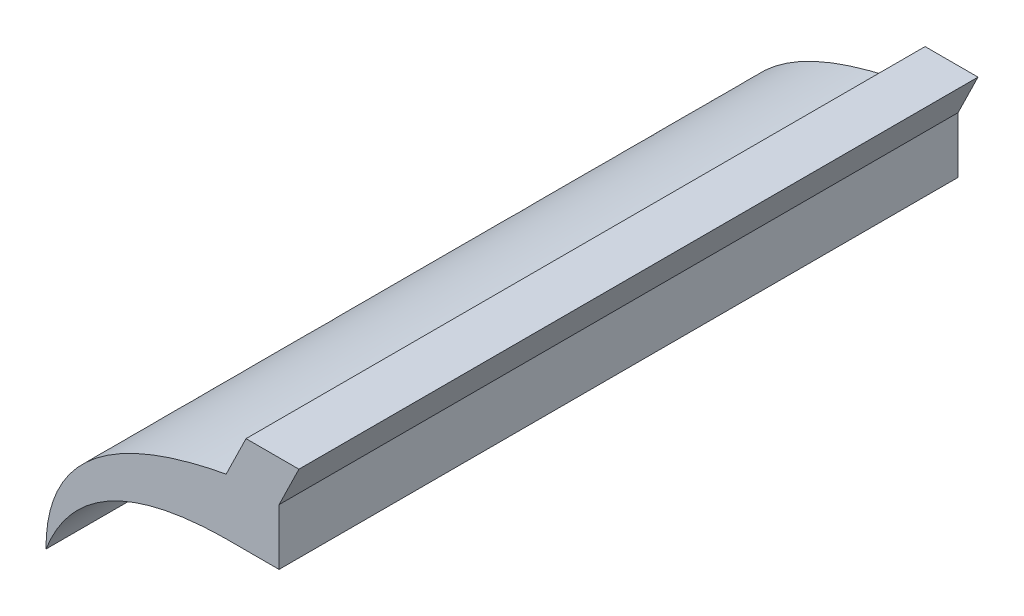
ISO-10303-21;
HEADER;
FILE_DESCRIPTION(('STEP AP214'),'2;1');
FILE_NAME('part.step','',(''),(''),'','','');
FILE_SCHEMA(('AUTOMOTIVE_DESIGN { 1 0 10303 214 1 1 1 1 }'));
ENDSEC;
DATA;
#1=APPLICATION_CONTEXT('core data for automotive mechanical design processes');
#2=APPLICATION_PROTOCOL_DEFINITION('international standard','automotive_design',2000,#1);
#3=PRODUCT_CONTEXT('',#1,'mechanical');
#4=PRODUCT('Part','Part','',(#3));
#5=PRODUCT_RELATED_PRODUCT_CATEGORY('part','',(#4));
#6=PRODUCT_DEFINITION_FORMATION('','',#4);
#7=PRODUCT_DEFINITION_CONTEXT('part definition',#1,'design');
#8=PRODUCT_DEFINITION('design','',#6,#7);
#9=PRODUCT_DEFINITION_SHAPE('','',#8);
#10=(LENGTH_UNIT() NAMED_UNIT(*) SI_UNIT(.MILLI.,.METRE.));
#11=(NAMED_UNIT(*) PLANE_ANGLE_UNIT() SI_UNIT($,.RADIAN.));
#12=(NAMED_UNIT(*) SI_UNIT($,.STERADIAN.) SOLID_ANGLE_UNIT());
#13=UNCERTAINTY_MEASURE_WITH_UNIT(LENGTH_MEASURE(1.E-05),#10,'distance_accuracy_value','');
#14=(GEOMETRIC_REPRESENTATION_CONTEXT(3) GLOBAL_UNCERTAINTY_ASSIGNED_CONTEXT((#13)) GLOBAL_UNIT_ASSIGNED_CONTEXT((#10,
#11,#12)) REPRESENTATION_CONTEXT('',''));
#15=CARTESIAN_POINT('',(0.,0.,0.));
#16=DIRECTION('',(0.,0.,1.));
#17=DIRECTION('',(1.,0.,0.));
#18=AXIS2_PLACEMENT_3D('',#15,#16,#17);
#19=CARTESIAN_POINT('',(-99.5275387279443,54.4598962525642,750.));
#20=CARTESIAN_POINT('',(-100.331758170618,188.294424485863,750.));
#21=CARTESIAN_POINT('',(99.4401717600514,225.622803561396,750.));
#22=B_SPLINE_CURVE_WITH_KNOTS('',2,(#19,#20,#21),.UNSPECIFIED.,.F.,.F.,(3,3),(0.,1.),.UNSPECIFIED.);
#23=DIRECTION('',(0.,0.,-1.));
#24=VECTOR('',#23,1.);
#25=SURFACE_OF_LINEAR_EXTRUSION('',#22,#24);
#26=CARTESIAN_POINT('',(-99.5275387279443,54.4598962525642,0.));
#27=CARTESIAN_POINT('',(-100.331758170618,188.294424485863,0.));
#28=CARTESIAN_POINT('',(99.4401717600514,225.622803561396,0.));
#29=B_SPLINE_CURVE_WITH_KNOTS('',2,(#26,#27,#28),.UNSPECIFIED.,.F.,.F.,(3,3),(0.,1.),.UNSPECIFIED.);
#30=CARTESIAN_POINT('',(-99.5275387279443,54.4598962525642,0.));
#31=VERTEX_POINT('',#30);
#32=CARTESIAN_POINT('',(99.4401717600514,225.622803561396,0.));
#33=VERTEX_POINT('',#32);
#34=EDGE_CURVE('E135',#31,#33,#29,.T.);
#35=ORIENTED_EDGE('',*,*,#34,.F.);
#36=DIRECTION('',(0.,0.,-1.));
#37=VECTOR('',#36,1.);
#38=CARTESIAN_POINT('',(-99.5275387279443,54.4598962525642,750.));
#39=LINE('',#38,#37);
#40=CARTESIAN_POINT('',(-99.5275387279443,54.4598962525642,750.));
#41=VERTEX_POINT('',#40);
#42=EDGE_CURVE('E11',#41,#31,#39,.T.);
#43=ORIENTED_EDGE('',*,*,#42,.F.);
#44=CARTESIAN_POINT('',(99.4401717600514,225.622803561396,750.));
#45=VERTEX_POINT('',#44);
#46=EDGE_CURVE('E169',#41,#45,#22,.T.);
#47=ORIENTED_EDGE('',*,*,#46,.T.);
#48=DIRECTION('',(0.,0.,-1.));
#49=VECTOR('',#48,1.);
#50=CARTESIAN_POINT('',(99.4401717600514,225.622803561396,750.));
#51=LINE('',#50,#49);
#52=EDGE_CURVE('E59',#45,#33,#51,.T.);
#53=ORIENTED_EDGE('',*,*,#52,.T.);
#54=EDGE_LOOP('',(#35,#43,#47,#53));
#55=FACE_BOUND('',#54,.T.);
#56=ADVANCED_FACE('F41',(#55),#25,.T.);
#57=CARTESIAN_POINT('',(-99.5275387279443,54.4598962525642,750.));
#58=CARTESIAN_POINT('',(-58.2410385135572,162.199954542295,750.));
#59=CARTESIAN_POINT('',(99.4401717600515,163.673388675734,750.));
#60=B_SPLINE_CURVE_WITH_KNOTS('',2,(#57,#58,#59),.UNSPECIFIED.,.F.,.F.,(3,3),(0.,1.),.UNSPECIFIED.);
#61=DIRECTION('',(0.,0.,-1.));
#62=VECTOR('',#61,1.);
#63=SURFACE_OF_LINEAR_EXTRUSION('',#60,#62);
#64=CARTESIAN_POINT('',(-99.5275387279443,54.4598962525642,0.));
#65=CARTESIAN_POINT('',(-58.2410385135572,162.199954542295,0.));
#66=CARTESIAN_POINT('',(99.4401717600515,163.673388675734,0.));
#67=B_SPLINE_CURVE_WITH_KNOTS('',2,(#64,#65,#66),.UNSPECIFIED.,.F.,.F.,(3,3),(0.,1.),.UNSPECIFIED.);
#68=CARTESIAN_POINT('',(99.4401717600514,163.673388675734,0.));
#69=VERTEX_POINT('',#68);
#70=EDGE_CURVE('E140',#31,#69,#67,.T.);
#71=ORIENTED_EDGE('',*,*,#70,.T.);
#72=DIRECTION('',(0.,0.,-1.));
#73=VECTOR('',#72,1.);
#74=CARTESIAN_POINT('',(99.4401717600514,163.673388675734,750.));
#75=LINE('',#74,#73);
#76=CARTESIAN_POINT('',(99.4401717600514,163.673388675734,750.));
#77=VERTEX_POINT('',#76);
#78=EDGE_CURVE('E51',#77,#69,#75,.T.);
#79=ORIENTED_EDGE('',*,*,#78,.F.);
#80=EDGE_CURVE('E193',#41,#77,#60,.T.);
#81=ORIENTED_EDGE('',*,*,#80,.F.);
#82=ORIENTED_EDGE('',*,*,#42,.T.);
#83=EDGE_LOOP('',(#71,#79,#81,#82));
#84=FACE_BOUND('',#83,.T.);
#85=ADVANCED_FACE('F187',(#84),#63,.F.);
#86=CARTESIAN_POINT('',(0.,163.673388675734,750.));
#87=DIRECTION('',(0.,-1.,0.));
#88=DIRECTION('',(0.,0.,-1.));
#89=AXIS2_PLACEMENT_3D('',#86,#87,#88);
#90=PLANE('',#89);
#91=DIRECTION('',(-1.,0.,0.));
#92=VECTOR('',#91,1.);
#93=CARTESIAN_POINT('',(0.,163.673388675734,0.));
#94=LINE('',#93,#92);
#95=CARTESIAN_POINT('',(157.870193301385,163.673388675734,0.));
#96=VERTEX_POINT('',#95);
#97=EDGE_CURVE('E149',#96,#69,#94,.T.);
#98=ORIENTED_EDGE('',*,*,#97,.F.);
#99=DIRECTION('',(0.,0.,-1.));
#100=VECTOR('',#99,1.);
#101=CARTESIAN_POINT('',(157.870193301385,163.673388675734,750.));
#102=LINE('',#101,#100);
#103=CARTESIAN_POINT('',(157.870193301385,163.673388675734,750.));
#104=VERTEX_POINT('',#103);
#105=EDGE_CURVE('E176',#104,#96,#102,.T.);
#106=ORIENTED_EDGE('',*,*,#105,.F.);
#107=DIRECTION('',(-1.,0.,0.));
#108=VECTOR('',#107,1.);
#109=CARTESIAN_POINT('',(0.,163.673388675734,750.));
#110=LINE('',#109,#108);
#111=EDGE_CURVE('E184',#104,#77,#110,.T.);
#112=ORIENTED_EDGE('',*,*,#111,.T.);
#113=ORIENTED_EDGE('',*,*,#78,.T.);
#114=EDGE_LOOP('',(#98,#106,#112,#113));
#115=FACE_BOUND('',#114,.T.);
#116=ADVANCED_FACE('F183',(#115),#90,.T.);
#117=CARTESIAN_POINT('',(157.870193301385,0.,750.));
#118=DIRECTION('',(1.,0.,0.));
#119=DIRECTION('',(0.,0.,-1.));
#120=AXIS2_PLACEMENT_3D('',#117,#118,#119);
#121=PLANE('',#120);
#122=DIRECTION('',(0.,-1.,0.));
#123=VECTOR('',#122,1.);
#124=CARTESIAN_POINT('',(157.870193301385,0.,0.));
#125=LINE('',#124,#123);
#126=CARTESIAN_POINT('',(157.870193301385,225.622803561396,0.));
#127=VERTEX_POINT('',#126);
#128=EDGE_CURVE('E156',#127,#96,#125,.T.);
#129=ORIENTED_EDGE('',*,*,#128,.F.);
#130=DIRECTION('',(0.,0.,-1.));
#131=VECTOR('',#130,1.);
#132=CARTESIAN_POINT('',(157.870193301385,225.622803561396,750.));
#133=LINE('',#132,#131);
#134=CARTESIAN_POINT('',(157.870193301385,225.622803561396,750.));
#135=VERTEX_POINT('',#134);
#136=EDGE_CURVE('E113',#135,#127,#133,.T.);
#137=ORIENTED_EDGE('',*,*,#136,.F.);
#138=DIRECTION('',(0.,-1.,0.));
#139=VECTOR('',#138,1.);
#140=CARTESIAN_POINT('',(157.870193301385,0.,750.));
#141=LINE('',#140,#139);
#142=EDGE_CURVE('E124',#135,#104,#141,.T.);
#143=ORIENTED_EDGE('',*,*,#142,.T.);
#144=ORIENTED_EDGE('',*,*,#105,.T.);
#145=EDGE_LOOP('',(#129,#137,#143,#144));
#146=FACE_BOUND('',#145,.T.);
#147=ADVANCED_FACE('F192',(#146),#121,.T.);
#148=CARTESIAN_POINT('',(38.4921884584138,-18.7998934485912,750.));
#149=DIRECTION('',(0.898554786865475,-0.438861361936933,0.));
#150=DIRECTION('',(0.438861361936933,0.898554786865476,0.));
#151=AXIS2_PLACEMENT_3D('',#148,#149,#150);
#152=PLANE('',#151);
#153=DIRECTION('',(-0.438861361936933,-0.898554786865476,0.));
#154=VECTOR('',#153,1.);
#155=CARTESIAN_POINT('',(38.4921884584138,-18.7998934485912,0.));
#156=LINE('',#155,#154);
#157=CARTESIAN_POINT('',(179.813261398231,270.55054290467,0.));
#158=VERTEX_POINT('',#157);
#159=EDGE_CURVE('E108',#158,#127,#156,.T.);
#160=ORIENTED_EDGE('',*,*,#159,.F.);
#161=DIRECTION('',(0.,0.,-1.));
#162=VECTOR('',#161,1.);
#163=CARTESIAN_POINT('',(179.813261398231,270.55054290467,750.));
#164=LINE('',#163,#162);
#165=CARTESIAN_POINT('',(179.813261398231,270.55054290467,750.));
#166=VERTEX_POINT('',#165);
#167=EDGE_CURVE('E103',#166,#158,#164,.T.);
#168=ORIENTED_EDGE('',*,*,#167,.F.);
#169=DIRECTION('',(-0.438861361936933,-0.898554786865476,0.));
#170=VECTOR('',#169,1.);
#171=CARTESIAN_POINT('',(38.4921884584138,-18.7998934485912,750.));
#172=LINE('',#171,#170);
#173=EDGE_CURVE('E106',#166,#135,#172,.T.);
#174=ORIENTED_EDGE('',*,*,#173,.T.);
#175=ORIENTED_EDGE('',*,*,#136,.T.);
#176=EDGE_LOOP('',(#160,#168,#174,#175));
#177=FACE_BOUND('',#176,.T.);
#178=ADVANCED_FACE('F105',(#177),#152,.T.);
#179=CARTESIAN_POINT('',(0.,270.55054290467,750.));
#180=DIRECTION('',(0.,1.,0.));
#181=DIRECTION('',(0.,0.,1.));
#182=AXIS2_PLACEMENT_3D('',#179,#180,#181);
#183=PLANE('',#182);
#184=DIRECTION('',(1.,0.,0.));
#185=VECTOR('',#184,1.);
#186=CARTESIAN_POINT('',(0.,270.55054290467,0.));
#187=LINE('',#186,#185);
#188=CARTESIAN_POINT('',(121.383239856898,270.55054290467,0.));
#189=VERTEX_POINT('',#188);
#190=EDGE_CURVE('E162',#189,#158,#187,.T.);
#191=ORIENTED_EDGE('',*,*,#190,.F.);
#192=DIRECTION('',(0.,0.,-1.));
#193=VECTOR('',#192,1.);
#194=CARTESIAN_POINT('',(121.383239856898,270.55054290467,750.));
#195=LINE('',#194,#193);
#196=CARTESIAN_POINT('',(121.383239856898,270.55054290467,750.));
#197=VERTEX_POINT('',#196);
#198=EDGE_CURVE('E81',#197,#189,#195,.T.);
#199=ORIENTED_EDGE('',*,*,#198,.F.);
#200=DIRECTION('',(1.,0.,0.));
#201=VECTOR('',#200,1.);
#202=CARTESIAN_POINT('',(0.,270.55054290467,750.));
#203=LINE('',#202,#201);
#204=EDGE_CURVE('E121',#197,#166,#203,.T.);
#205=ORIENTED_EDGE('',*,*,#204,.T.);
#206=ORIENTED_EDGE('',*,*,#167,.T.);
#207=EDGE_LOOP('',(#191,#199,#205,#206));
#208=FACE_BOUND('',#207,.T.);
#209=ADVANCED_FACE('F127',(#208),#183,.T.);
#210=CARTESIAN_POINT('',(-8.6842521271572,4.2414583636273,750.));
#211=DIRECTION('',(-0.898554786865476,0.438861361936933,0.));
#212=DIRECTION('',(-0.438861361936933,-0.898554786865476,0.));
#213=AXIS2_PLACEMENT_3D('',#210,#211,#212);
#214=PLANE('',#213);
#215=DIRECTION('',(0.438861361936933,0.898554786865476,0.));
#216=VECTOR('',#215,1.);
#217=CARTESIAN_POINT('',(-8.6842521271572,4.2414583636273,0.));
#218=LINE('',#217,#216);
#219=EDGE_CURVE('E165',#33,#189,#218,.T.);
#220=ORIENTED_EDGE('',*,*,#219,.F.);
#221=ORIENTED_EDGE('',*,*,#52,.F.);
#222=DIRECTION('',(0.438861361936933,0.898554786865476,0.));
#223=VECTOR('',#222,1.);
#224=CARTESIAN_POINT('',(-8.6842521271572,4.2414583636273,750.));
#225=LINE('',#224,#223);
#226=EDGE_CURVE('E129',#45,#197,#225,.T.);
#227=ORIENTED_EDGE('',*,*,#226,.T.);
#228=ORIENTED_EDGE('',*,*,#198,.T.);
#229=EDGE_LOOP('',(#220,#221,#227,#228));
#230=FACE_BOUND('',#229,.T.);
#231=ADVANCED_FACE('F218',(#230),#214,.T.);
#232=CARTESIAN_POINT('',(0.,0.,750.));
#233=DIRECTION('',(0.,0.,1.));
#234=DIRECTION('',(1.,0.,0.));
#235=AXIS2_PLACEMENT_3D('',#232,#233,#234);
#236=PLANE('',#235);
#237=ORIENTED_EDGE('',*,*,#46,.F.);
#238=ORIENTED_EDGE('',*,*,#80,.T.);
#239=ORIENTED_EDGE('',*,*,#111,.F.);
#240=ORIENTED_EDGE('',*,*,#142,.F.);
#241=ORIENTED_EDGE('',*,*,#173,.F.);
#242=ORIENTED_EDGE('',*,*,#204,.F.);
#243=ORIENTED_EDGE('',*,*,#226,.F.);
#244=EDGE_LOOP('',(#237,#238,#239,#240,#241,#242,#243));
#245=FACE_BOUND('',#244,.T.);
#246=ADVANCED_FACE('F119',(#245),#236,.T.);
#247=CARTESIAN_POINT('',(0.,0.,0.));
#248=DIRECTION('',(0.,0.,1.));
#249=DIRECTION('',(1.,0.,0.));
#250=AXIS2_PLACEMENT_3D('',#247,#248,#249);
#251=PLANE('',#250);
#252=ORIENTED_EDGE('',*,*,#34,.T.);
#253=ORIENTED_EDGE('',*,*,#219,.T.);
#254=ORIENTED_EDGE('',*,*,#190,.T.);
#255=ORIENTED_EDGE('',*,*,#159,.T.);
#256=ORIENTED_EDGE('',*,*,#128,.T.);
#257=ORIENTED_EDGE('',*,*,#97,.T.);
#258=ORIENTED_EDGE('',*,*,#70,.F.);
#259=EDGE_LOOP('',(#252,#253,#254,#255,#256,#257,#258));
#260=FACE_BOUND('',#259,.T.);
#261=ADVANCED_FACE('F189',(#260),#251,.F.);
#262=CLOSED_SHELL('',(#56,#85,#116,#147,#178,#209,#231,#246,#261));
#263=MANIFOLD_SOLID_BREP('B2',#262);
#264=ADVANCED_BREP_SHAPE_REPRESENTATION('',(#18,#263),#14);
#265=SHAPE_DEFINITION_REPRESENTATION(#9,#264);
ENDSEC;
END-ISO-10303-21;
